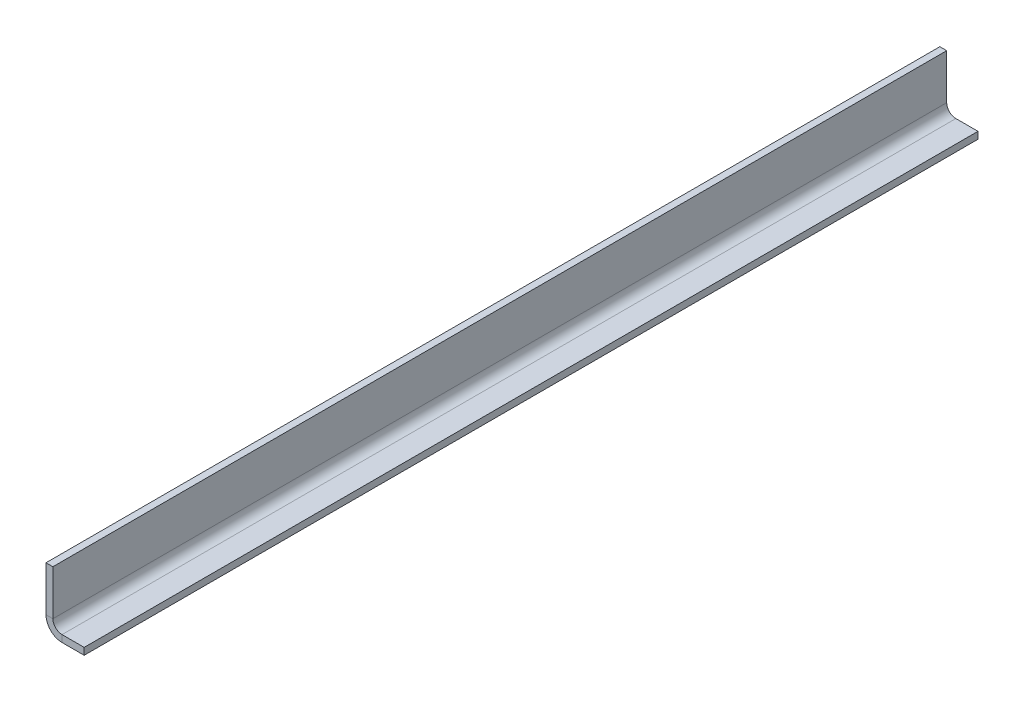
ISO-10303-21;
HEADER;
FILE_DESCRIPTION(('STEP AP214'),'2;1');
FILE_NAME('part.step','',(''),(''),'','','');
FILE_SCHEMA(('AUTOMOTIVE_DESIGN { 1 0 10303 214 1 1 1 1 }'));
ENDSEC;
DATA;
#1=APPLICATION_CONTEXT('core data for automotive mechanical design processes');
#2=APPLICATION_PROTOCOL_DEFINITION('international standard','automotive_design',2000,#1);
#3=PRODUCT_CONTEXT('',#1,'mechanical');
#4=PRODUCT('Part','Part','',(#3));
#5=PRODUCT_RELATED_PRODUCT_CATEGORY('part','',(#4));
#6=PRODUCT_DEFINITION_FORMATION('','',#4);
#7=PRODUCT_DEFINITION_CONTEXT('part definition',#1,'design');
#8=PRODUCT_DEFINITION('design','',#6,#7);
#9=PRODUCT_DEFINITION_SHAPE('','',#8);
#10=(LENGTH_UNIT() NAMED_UNIT(*) SI_UNIT(.MILLI.,.METRE.));
#11=(NAMED_UNIT(*) PLANE_ANGLE_UNIT() SI_UNIT($,.RADIAN.));
#12=(NAMED_UNIT(*) SI_UNIT($,.STERADIAN.) SOLID_ANGLE_UNIT());
#13=UNCERTAINTY_MEASURE_WITH_UNIT(LENGTH_MEASURE(1.E-05),#10,'distance_accuracy_value','');
#14=(GEOMETRIC_REPRESENTATION_CONTEXT(3) GLOBAL_UNCERTAINTY_ASSIGNED_CONTEXT((#13)) GLOBAL_UNIT_ASSIGNED_CONTEXT((#10,
#11,#12)) REPRESENTATION_CONTEXT('',''));
#15=CARTESIAN_POINT('',(0.,0.,0.));
#16=DIRECTION('',(0.,0.,1.));
#17=DIRECTION('',(1.,0.,0.));
#18=AXIS2_PLACEMENT_3D('',#15,#16,#17);
#19=CARTESIAN_POINT('',(3.175,3.175,0.));
#20=DIRECTION('',(0.,0.,1.));
#21=DIRECTION('',(0.,1.,0.));
#22=AXIS2_PLACEMENT_3D('',#19,#20,#21);
#23=PLANE('',#22);
#24=DIRECTION('',(1.,0.,0.));
#25=VECTOR('',#24,1.);
#26=CARTESIAN_POINT('',(3.175,5.175,0.));
#27=LINE('',#26,#25);
#28=CARTESIAN_POINT('',(1.675,5.175,0.));
#29=VERTEX_POINT('',#28);
#30=CARTESIAN_POINT('',(3.175,5.175,0.));
#31=VERTEX_POINT('',#30);
#32=EDGE_CURVE('E11',#29,#31,#27,.T.);
#33=ORIENTED_EDGE('',*,*,#32,.F.);
#34=DIRECTION('',(0.,1.,0.));
#35=VECTOR('',#34,1.);
#36=CARTESIAN_POINT('',(1.675,3.175,0.));
#37=LINE('',#36,#35);
#38=CARTESIAN_POINT('',(1.675,15.,0.));
#39=VERTEX_POINT('',#38);
#40=EDGE_CURVE('E93',#29,#39,#37,.T.);
#41=ORIENTED_EDGE('',*,*,#40,.T.);
#42=DIRECTION('',(1.,0.,0.));
#43=VECTOR('',#42,1.);
#44=CARTESIAN_POINT('',(3.175,15.,0.));
#45=LINE('',#44,#43);
#46=CARTESIAN_POINT('',(3.175,15.,0.));
#47=VERTEX_POINT('',#46);
#48=EDGE_CURVE('E53',#39,#47,#45,.T.);
#49=ORIENTED_EDGE('',*,*,#48,.T.);
#50=DIRECTION('',(0.,1.,0.));
#51=VECTOR('',#50,1.);
#52=CARTESIAN_POINT('',(3.175,3.175,0.));
#53=LINE('',#52,#51);
#54=EDGE_CURVE('E96',#31,#47,#53,.T.);
#55=ORIENTED_EDGE('',*,*,#54,.F.);
#56=EDGE_LOOP('',(#33,#41,#49,#55));
#57=FACE_BOUND('',#56,.T.);
#58=ADVANCED_FACE('F43',(#57),#23,.F.);
#59=CARTESIAN_POINT('',(3.175,15.,195.));
#60=DIRECTION('',(0.,1.,0.));
#61=DIRECTION('',(0.,0.,-1.));
#62=AXIS2_PLACEMENT_3D('',#59,#60,#61);
#63=PLANE('',#62);
#64=ORIENTED_EDGE('',*,*,#48,.F.);
#65=DIRECTION('',(0.,0.,1.));
#66=VECTOR('',#65,1.);
#67=CARTESIAN_POINT('',(1.675,15.,195.));
#68=LINE('',#67,#66);
#69=CARTESIAN_POINT('',(1.675,15.,195.));
#70=VERTEX_POINT('',#69);
#71=EDGE_CURVE('E121',#70,#39,#68,.F.);
#72=ORIENTED_EDGE('',*,*,#71,.F.);
#73=DIRECTION('',(1.,0.,0.));
#74=VECTOR('',#73,1.);
#75=CARTESIAN_POINT('',(3.175,15.,195.));
#76=LINE('',#75,#74);
#77=CARTESIAN_POINT('',(3.175,15.,195.));
#78=VERTEX_POINT('',#77);
#79=EDGE_CURVE('E139',#70,#78,#76,.T.);
#80=ORIENTED_EDGE('',*,*,#79,.T.);
#81=DIRECTION('',(0.,0.,-1.));
#82=VECTOR('',#81,1.);
#83=CARTESIAN_POINT('',(3.175,15.,195.));
#84=LINE('',#83,#82);
#85=EDGE_CURVE('E150',#78,#47,#84,.T.);
#86=ORIENTED_EDGE('',*,*,#85,.T.);
#87=EDGE_LOOP('',(#64,#72,#80,#86));
#88=FACE_BOUND('',#87,.T.);
#89=ADVANCED_FACE('F156',(#88),#63,.T.);
#90=CARTESIAN_POINT('',(3.175,3.175,195.));
#91=DIRECTION('',(0.,0.,1.));
#92=DIRECTION('',(0.,1.,0.));
#93=AXIS2_PLACEMENT_3D('',#90,#91,#92);
#94=PLANE('',#93);
#95=ORIENTED_EDGE('',*,*,#79,.F.);
#96=DIRECTION('',(0.,1.,0.));
#97=VECTOR('',#96,1.);
#98=CARTESIAN_POINT('',(1.675,3.175,195.));
#99=LINE('',#98,#97);
#100=CARTESIAN_POINT('',(1.675,5.175,195.));
#101=VERTEX_POINT('',#100);
#102=EDGE_CURVE('E181',#101,#70,#99,.T.);
#103=ORIENTED_EDGE('',*,*,#102,.F.);
#104=DIRECTION('',(1.,0.,0.));
#105=VECTOR('',#104,1.);
#106=CARTESIAN_POINT('',(3.175,5.175,195.));
#107=LINE('',#106,#105);
#108=CARTESIAN_POINT('',(3.175,5.175,195.));
#109=VERTEX_POINT('',#108);
#110=EDGE_CURVE('E136',#101,#109,#107,.T.);
#111=ORIENTED_EDGE('',*,*,#110,.T.);
#112=DIRECTION('',(0.,1.,0.));
#113=VECTOR('',#112,1.);
#114=CARTESIAN_POINT('',(3.175,3.175,195.));
#115=LINE('',#114,#113);
#116=EDGE_CURVE('E157',#109,#78,#115,.T.);
#117=ORIENTED_EDGE('',*,*,#116,.T.);
#118=EDGE_LOOP('',(#95,#103,#111,#117));
#119=FACE_BOUND('',#118,.T.);
#120=ADVANCED_FACE('F187',(#119),#94,.T.);
#121=CARTESIAN_POINT('',(5.175,5.175,195.));
#122=DIRECTION('',(0.,0.,1.));
#123=DIRECTION('',(1.,0.,0.));
#124=AXIS2_PLACEMENT_3D('',#121,#122,#123);
#125=PLANE('',#124);
#126=ORIENTED_EDGE('',*,*,#110,.F.);
#127=CARTESIAN_POINT('',(5.175,5.175,195.));
#128=DIRECTION('',(0.,0.,1.));
#129=DIRECTION('',(1.,0.,0.));
#130=AXIS2_PLACEMENT_3D('',#127,#128,#129);
#131=CIRCLE('',#130,3.5);
#132=CARTESIAN_POINT('',(5.175,1.675,195.));
#133=VERTEX_POINT('',#132);
#134=EDGE_CURVE('E111',#101,#133,#131,.T.);
#135=ORIENTED_EDGE('',*,*,#134,.T.);
#136=DIRECTION('',(0.,1.,0.));
#137=VECTOR('',#136,1.);
#138=CARTESIAN_POINT('',(5.175,3.175,195.));
#139=LINE('',#138,#137);
#140=CARTESIAN_POINT('',(5.175,3.175,195.));
#141=VERTEX_POINT('',#140);
#142=EDGE_CURVE('E61',#133,#141,#139,.T.);
#143=ORIENTED_EDGE('',*,*,#142,.T.);
#144=CARTESIAN_POINT('',(5.175,5.175,195.));
#145=DIRECTION('',(0.,0.,-1.));
#146=DIRECTION('',(-1.,0.,0.));
#147=AXIS2_PLACEMENT_3D('',#144,#145,#146);
#148=CIRCLE('',#147,2.);
#149=EDGE_CURVE('E154',#109,#141,#148,.F.);
#150=ORIENTED_EDGE('',*,*,#149,.F.);
#151=EDGE_LOOP('',(#126,#135,#143,#150));
#152=FACE_BOUND('',#151,.T.);
#153=ADVANCED_FACE('F190',(#152),#125,.T.);
#154=CARTESIAN_POINT('',(10.,3.175,195.));
#155=DIRECTION('',(0.,0.,1.));
#156=DIRECTION('',(-1.,0.,0.));
#157=AXIS2_PLACEMENT_3D('',#154,#155,#156);
#158=PLANE('',#157);
#159=ORIENTED_EDGE('',*,*,#142,.F.);
#160=DIRECTION('',(1.,0.,0.));
#161=VECTOR('',#160,1.);
#162=CARTESIAN_POINT('',(10.,1.675,195.));
#163=LINE('',#162,#161);
#164=CARTESIAN_POINT('',(10.,1.675,195.));
#165=VERTEX_POINT('',#164);
#166=EDGE_CURVE('E180',#165,#133,#163,.F.);
#167=ORIENTED_EDGE('',*,*,#166,.F.);
#168=DIRECTION('',(0.,1.,0.));
#169=VECTOR('',#168,1.);
#170=CARTESIAN_POINT('',(10.,3.175,195.));
#171=LINE('',#170,#169);
#172=CARTESIAN_POINT('',(10.,3.175,195.));
#173=VERTEX_POINT('',#172);
#174=EDGE_CURVE('E132',#165,#173,#171,.T.);
#175=ORIENTED_EDGE('',*,*,#174,.T.);
#176=DIRECTION('',(-1.,0.,0.));
#177=VECTOR('',#176,1.);
#178=CARTESIAN_POINT('',(10.,3.175,195.));
#179=LINE('',#178,#177);
#180=EDGE_CURVE('E164',#173,#141,#179,.T.);
#181=ORIENTED_EDGE('',*,*,#180,.T.);
#182=EDGE_LOOP('',(#159,#167,#175,#181));
#183=FACE_BOUND('',#182,.T.);
#184=ADVANCED_FACE('F201',(#183),#158,.T.);
#185=CARTESIAN_POINT('',(10.,3.175,195.));
#186=DIRECTION('',(-1.,0.,0.));
#187=DIRECTION('',(0.,0.,-1.));
#188=AXIS2_PLACEMENT_3D('',#185,#186,#187);
#189=PLANE('',#188);
#190=ORIENTED_EDGE('',*,*,#174,.F.);
#191=DIRECTION('',(0.,0.,1.));
#192=VECTOR('',#191,1.);
#193=CARTESIAN_POINT('',(10.,1.675,195.));
#194=LINE('',#193,#192);
#195=CARTESIAN_POINT('',(10.,1.675,0.));
#196=VERTEX_POINT('',#195);
#197=EDGE_CURVE('E116',#165,#196,#194,.F.);
#198=ORIENTED_EDGE('',*,*,#197,.T.);
#199=DIRECTION('',(0.,1.,0.));
#200=VECTOR('',#199,1.);
#201=CARTESIAN_POINT('',(10.,3.175,0.));
#202=LINE('',#201,#200);
#203=CARTESIAN_POINT('',(10.,3.175,0.));
#204=VERTEX_POINT('',#203);
#205=EDGE_CURVE('E129',#196,#204,#202,.T.);
#206=ORIENTED_EDGE('',*,*,#205,.T.);
#207=DIRECTION('',(0.,0.,-1.));
#208=VECTOR('',#207,1.);
#209=CARTESIAN_POINT('',(10.,3.175,195.));
#210=LINE('',#209,#208);
#211=EDGE_CURVE('E167',#173,#204,#210,.T.);
#212=ORIENTED_EDGE('',*,*,#211,.F.);
#213=EDGE_LOOP('',(#190,#198,#206,#212));
#214=FACE_BOUND('',#213,.T.);
#215=ADVANCED_FACE('F207',(#214),#189,.F.);
#216=CARTESIAN_POINT('',(10.,3.175,0.));
#217=DIRECTION('',(0.,0.,1.));
#218=DIRECTION('',(-1.,0.,0.));
#219=AXIS2_PLACEMENT_3D('',#216,#217,#218);
#220=PLANE('',#219);
#221=ORIENTED_EDGE('',*,*,#205,.F.);
#222=DIRECTION('',(1.,0.,0.));
#223=VECTOR('',#222,1.);
#224=CARTESIAN_POINT('',(10.,1.675,0.));
#225=LINE('',#224,#223);
#226=CARTESIAN_POINT('',(5.175,1.675,0.));
#227=VERTEX_POINT('',#226);
#228=EDGE_CURVE('E178',#196,#227,#225,.F.);
#229=ORIENTED_EDGE('',*,*,#228,.T.);
#230=DIRECTION('',(0.,1.,0.));
#231=VECTOR('',#230,1.);
#232=CARTESIAN_POINT('',(5.175,3.175,0.));
#233=LINE('',#232,#231);
#234=CARTESIAN_POINT('',(5.175,3.175,0.));
#235=VERTEX_POINT('',#234);
#236=EDGE_CURVE('E47',#227,#235,#233,.T.);
#237=ORIENTED_EDGE('',*,*,#236,.T.);
#238=DIRECTION('',(-1.,0.,0.));
#239=VECTOR('',#238,1.);
#240=CARTESIAN_POINT('',(10.,3.175,0.));
#241=LINE('',#240,#239);
#242=EDGE_CURVE('E159',#204,#235,#241,.T.);
#243=ORIENTED_EDGE('',*,*,#242,.F.);
#244=EDGE_LOOP('',(#221,#229,#237,#243));
#245=FACE_BOUND('',#244,.T.);
#246=ADVANCED_FACE('F211',(#245),#220,.F.);
#247=CARTESIAN_POINT('',(5.175,5.175,0.));
#248=DIRECTION('',(0.,0.,-1.));
#249=DIRECTION('',(-1.,0.,0.));
#250=AXIS2_PLACEMENT_3D('',#247,#248,#249);
#251=PLANE('',#250);
#252=CARTESIAN_POINT('',(5.175,5.175,0.));
#253=DIRECTION('',(0.,0.,1.));
#254=DIRECTION('',(1.,0.,0.));
#255=AXIS2_PLACEMENT_3D('',#252,#253,#254);
#256=CIRCLE('',#255,3.5);
#257=EDGE_CURVE('E109',#227,#29,#256,.F.);
#258=ORIENTED_EDGE('',*,*,#257,.T.);
#259=ORIENTED_EDGE('',*,*,#32,.T.);
#260=CARTESIAN_POINT('',(5.175,5.175,0.));
#261=DIRECTION('',(0.,0.,1.));
#262=DIRECTION('',(1.,0.,0.));
#263=AXIS2_PLACEMENT_3D('',#260,#261,#262);
#264=CIRCLE('',#263,2.);
#265=EDGE_CURVE('E174',#235,#31,#264,.F.);
#266=ORIENTED_EDGE('',*,*,#265,.F.);
#267=ORIENTED_EDGE('',*,*,#236,.F.);
#268=EDGE_LOOP('',(#258,#259,#266,#267));
#269=FACE_BOUND('',#268,.T.);
#270=ADVANCED_FACE('F45',(#269),#251,.T.);
#271=CARTESIAN_POINT('',(10.,3.175,195.));
#272=DIRECTION('',(0.,-1.,0.));
#273=DIRECTION('',(1.,0.,0.));
#274=AXIS2_PLACEMENT_3D('',#271,#272,#273);
#275=PLANE('',#274);
#276=ORIENTED_EDGE('',*,*,#242,.T.);
#277=DIRECTION('',(0.,0.,-1.));
#278=VECTOR('',#277,1.);
#279=CARTESIAN_POINT('',(5.175,3.175,195.));
#280=LINE('',#279,#278);
#281=EDGE_CURVE('E171',#235,#141,#280,.F.);
#282=ORIENTED_EDGE('',*,*,#281,.T.);
#283=ORIENTED_EDGE('',*,*,#180,.F.);
#284=ORIENTED_EDGE('',*,*,#211,.T.);
#285=EDGE_LOOP('',(#276,#282,#283,#284));
#286=FACE_BOUND('',#285,.T.);
#287=ADVANCED_FACE('F206',(#286),#275,.F.);
#288=CARTESIAN_POINT('',(3.175,3.175,195.));
#289=DIRECTION('',(-1.,0.,0.));
#290=DIRECTION('',(0.,0.,1.));
#291=AXIS2_PLACEMENT_3D('',#288,#289,#290);
#292=PLANE('',#291);
#293=ORIENTED_EDGE('',*,*,#116,.F.);
#294=DIRECTION('',(0.,0.,-1.));
#295=VECTOR('',#294,1.);
#296=CARTESIAN_POINT('',(3.175,5.175,0.));
#297=LINE('',#296,#295);
#298=EDGE_CURVE('E153',#109,#31,#297,.T.);
#299=ORIENTED_EDGE('',*,*,#298,.T.);
#300=ORIENTED_EDGE('',*,*,#54,.T.);
#301=ORIENTED_EDGE('',*,*,#85,.F.);
#302=EDGE_LOOP('',(#293,#299,#300,#301));
#303=FACE_BOUND('',#302,.T.);
#304=ADVANCED_FACE('F149',(#303),#292,.F.);
#305=CARTESIAN_POINT('',(5.175,5.175,195.));
#306=DIRECTION('',(0.,0.,1.));
#307=DIRECTION('',(1.,0.,0.));
#308=AXIS2_PLACEMENT_3D('',#305,#306,#307);
#309=CYLINDRICAL_SURFACE('',#308,2.);
#310=ORIENTED_EDGE('',*,*,#149,.T.);
#311=ORIENTED_EDGE('',*,*,#281,.F.);
#312=ORIENTED_EDGE('',*,*,#265,.T.);
#313=ORIENTED_EDGE('',*,*,#298,.F.);
#314=EDGE_LOOP('',(#310,#311,#312,#313));
#315=FACE_BOUND('',#314,.T.);
#316=ADVANCED_FACE('F193',(#315),#309,.F.);
#317=CARTESIAN_POINT('',(10.,1.675,195.));
#318=DIRECTION('',(0.,-1.,0.));
#319=DIRECTION('',(1.,0.,0.));
#320=AXIS2_PLACEMENT_3D('',#317,#318,#319);
#321=PLANE('',#320);
#322=ORIENTED_EDGE('',*,*,#228,.F.);
#323=ORIENTED_EDGE('',*,*,#197,.F.);
#324=ORIENTED_EDGE('',*,*,#166,.T.);
#325=DIRECTION('',(0.,0.,1.));
#326=VECTOR('',#325,1.);
#327=CARTESIAN_POINT('',(5.175,1.675,195.));
#328=LINE('',#327,#326);
#329=EDGE_CURVE('E115',#227,#133,#328,.T.);
#330=ORIENTED_EDGE('',*,*,#329,.F.);
#331=EDGE_LOOP('',(#322,#323,#324,#330));
#332=FACE_BOUND('',#331,.T.);
#333=ADVANCED_FACE('F213',(#332),#321,.T.);
#334=CARTESIAN_POINT('',(1.675,3.175,195.));
#335=DIRECTION('',(-1.,0.,0.));
#336=DIRECTION('',(0.,0.,1.));
#337=AXIS2_PLACEMENT_3D('',#334,#335,#336);
#338=PLANE('',#337);
#339=ORIENTED_EDGE('',*,*,#102,.T.);
#340=ORIENTED_EDGE('',*,*,#71,.T.);
#341=ORIENTED_EDGE('',*,*,#40,.F.);
#342=DIRECTION('',(0.,0.,1.));
#343=VECTOR('',#342,1.);
#344=CARTESIAN_POINT('',(1.675,5.175,195.));
#345=LINE('',#344,#343);
#346=EDGE_CURVE('E106',#101,#29,#345,.F.);
#347=ORIENTED_EDGE('',*,*,#346,.F.);
#348=EDGE_LOOP('',(#339,#340,#341,#347));
#349=FACE_BOUND('',#348,.T.);
#350=ADVANCED_FACE('F119',(#349),#338,.T.);
#351=CARTESIAN_POINT('',(5.175,5.175,195.));
#352=DIRECTION('',(0.,0.,1.));
#353=DIRECTION('',(1.,0.,0.));
#354=AXIS2_PLACEMENT_3D('',#351,#352,#353);
#355=CYLINDRICAL_SURFACE('',#354,3.5);
#356=ORIENTED_EDGE('',*,*,#134,.F.);
#357=ORIENTED_EDGE('',*,*,#346,.T.);
#358=ORIENTED_EDGE('',*,*,#257,.F.);
#359=ORIENTED_EDGE('',*,*,#329,.T.);
#360=EDGE_LOOP('',(#356,#357,#358,#359));
#361=FACE_BOUND('',#360,.T.);
#362=ADVANCED_FACE('F107',(#361),#355,.T.);
#363=CLOSED_SHELL('',(#58,#89,#120,#153,#184,#215,#246,#270,#287,#304,#316,#333,#350,#362));
#364=MANIFOLD_SOLID_BREP('B2',#363);
#365=ADVANCED_BREP_SHAPE_REPRESENTATION('',(#18,#364),#14);
#366=SHAPE_DEFINITION_REPRESENTATION(#9,#365);
ENDSEC;
END-ISO-10303-21;
